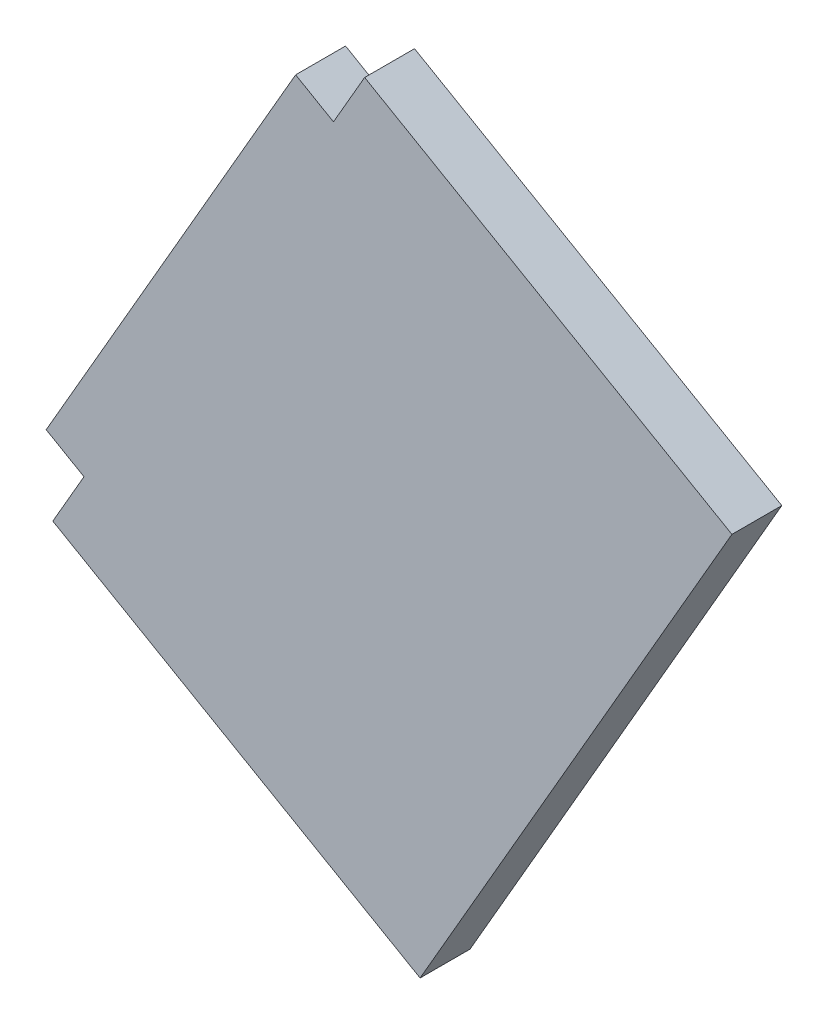
ISO-10303-21;
HEADER;
FILE_DESCRIPTION(('STEP AP214'),'2;1');
FILE_NAME('part.step','',(''),(''),'','','');
FILE_SCHEMA(('AUTOMOTIVE_DESIGN { 1 0 10303 214 1 1 1 1 }'));
ENDSEC;
DATA;
#1=APPLICATION_CONTEXT('core data for automotive mechanical design processes');
#2=APPLICATION_PROTOCOL_DEFINITION('international standard','automotive_design',2000,#1);
#3=PRODUCT_CONTEXT('',#1,'mechanical');
#4=PRODUCT('Part','Part','',(#3));
#5=PRODUCT_RELATED_PRODUCT_CATEGORY('part','',(#4));
#6=PRODUCT_DEFINITION_FORMATION('','',#4);
#7=PRODUCT_DEFINITION_CONTEXT('part definition',#1,'design');
#8=PRODUCT_DEFINITION('design','',#6,#7);
#9=PRODUCT_DEFINITION_SHAPE('','',#8);
#10=(LENGTH_UNIT() NAMED_UNIT(*) SI_UNIT(.MILLI.,.METRE.));
#11=(NAMED_UNIT(*) PLANE_ANGLE_UNIT() SI_UNIT($,.RADIAN.));
#12=(NAMED_UNIT(*) SI_UNIT($,.STERADIAN.) SOLID_ANGLE_UNIT());
#13=UNCERTAINTY_MEASURE_WITH_UNIT(LENGTH_MEASURE(1.E-05),#10,'distance_accuracy_value','');
#14=(GEOMETRIC_REPRESENTATION_CONTEXT(3) GLOBAL_UNCERTAINTY_ASSIGNED_CONTEXT((#13)) GLOBAL_UNIT_ASSIGNED_CONTEXT((#10,
#11,#12)) REPRESENTATION_CONTEXT('',''));
#15=CARTESIAN_POINT('',(0.,0.,0.));
#16=DIRECTION('',(0.,0.,1.));
#17=DIRECTION('',(1.,0.,0.));
#18=AXIS2_PLACEMENT_3D('',#15,#16,#17);
#19=CARTESIAN_POINT('',(1.92664718204935,-0.535,0.));
#20=DIRECTION('',(0.499999999999999,0.866025403784439,0.));
#21=DIRECTION('',(-0.866025403784439,0.499999999999999,0.));
#22=AXIS2_PLACEMENT_3D('',#19,#20,#21);
#23=PLANE('',#22);
#24=DIRECTION('',(-0.866025403784439,0.499999999999999,0.));
#25=VECTOR('',#24,1.);
#26=CARTESIAN_POINT('',(1.92664718204935,-0.535,0.08));
#27=LINE('',#26,#25);
#28=CARTESIAN_POINT('',(2.51554445662277,-0.875,0.08));
#29=VERTEX_POINT('',#28);
#30=CARTESIAN_POINT('',(1.92664718204935,-0.535,0.08));
#31=VERTEX_POINT('',#30);
#32=EDGE_CURVE('E130',#29,#31,#27,.T.);
#33=ORIENTED_EDGE('',*,*,#32,.F.);
#34=DIRECTION('',(0.,0.,1.));
#35=VECTOR('',#34,1.);
#36=CARTESIAN_POINT('',(2.51554445662277,-0.875,0.));
#37=LINE('',#36,#35);
#38=CARTESIAN_POINT('',(2.51554445662277,-0.875,0.));
#39=VERTEX_POINT('',#38);
#40=EDGE_CURVE('E11',#39,#29,#37,.T.);
#41=ORIENTED_EDGE('',*,*,#40,.F.);
#42=DIRECTION('',(-0.866025403784439,0.499999999999999,0.));
#43=VECTOR('',#42,1.);
#44=CARTESIAN_POINT('',(1.92664718204935,-0.535,0.));
#45=LINE('',#44,#43);
#46=CARTESIAN_POINT('',(1.92664718204935,-0.535,0.));
#47=VERTEX_POINT('',#46);
#48=EDGE_CURVE('E150',#39,#47,#45,.T.);
#49=ORIENTED_EDGE('',*,*,#48,.T.);
#50=DIRECTION('',(0.,0.,1.));
#51=VECTOR('',#50,1.);
#52=CARTESIAN_POINT('',(1.92664718204935,-0.535,0.));
#53=LINE('',#52,#51);
#54=EDGE_CURVE('E36',#47,#31,#53,.T.);
#55=ORIENTED_EDGE('',*,*,#54,.T.);
#56=EDGE_LOOP('',(#33,#41,#49,#55));
#57=FACE_BOUND('',#56,.T.);
#58=ADVANCED_FACE('F33',(#57),#23,.T.);
#59=CARTESIAN_POINT('',(2.01554445662277,-1.74102540378444,0.));
#60=DIRECTION('',(0.866025403784439,-0.5,0.));
#61=DIRECTION('',(0.5,0.866025403784439,0.));
#62=AXIS2_PLACEMENT_3D('',#59,#60,#61);
#63=PLANE('',#62);
#64=DIRECTION('',(0.5,0.866025403784439,0.));
#65=VECTOR('',#64,1.);
#66=CARTESIAN_POINT('',(2.01554445662277,-1.74102540378444,0.08));
#67=LINE('',#66,#65);
#68=CARTESIAN_POINT('',(2.01554445662277,-1.74102540378444,0.08));
#69=VERTEX_POINT('',#68);
#70=EDGE_CURVE('E148',#69,#29,#67,.T.);
#71=ORIENTED_EDGE('',*,*,#70,.F.);
#72=DIRECTION('',(0.,0.,1.));
#73=VECTOR('',#72,1.);
#74=CARTESIAN_POINT('',(2.01554445662277,-1.74102540378444,0.));
#75=LINE('',#74,#73);
#76=CARTESIAN_POINT('',(2.01554445662277,-1.74102540378444,0.));
#77=VERTEX_POINT('',#76);
#78=EDGE_CURVE('E42',#77,#69,#75,.T.);
#79=ORIENTED_EDGE('',*,*,#78,.F.);
#80=DIRECTION('',(0.5,0.866025403784439,0.));
#81=VECTOR('',#80,1.);
#82=CARTESIAN_POINT('',(2.01554445662277,-1.74102540378444,0.));
#83=LINE('',#82,#81);
#84=EDGE_CURVE('E120',#77,#39,#83,.T.);
#85=ORIENTED_EDGE('',*,*,#84,.T.);
#86=ORIENTED_EDGE('',*,*,#40,.T.);
#87=EDGE_LOOP('',(#71,#79,#85,#86));
#88=FACE_BOUND('',#87,.T.);
#89=ADVANCED_FACE('F162',(#88),#63,.T.);
#90=CARTESIAN_POINT('',(1.42664718204935,-1.40102540378444,0.));
#91=DIRECTION('',(-0.5,-0.866025403784439,0.));
#92=DIRECTION('',(0.866025403784439,-0.5,0.));
#93=AXIS2_PLACEMENT_3D('',#90,#91,#92);
#94=PLANE('',#93);
#95=DIRECTION('',(0.866025403784439,-0.5,0.));
#96=VECTOR('',#95,1.);
#97=CARTESIAN_POINT('',(1.42664718204935,-1.40102540378444,0.08));
#98=LINE('',#97,#96);
#99=CARTESIAN_POINT('',(1.42664718204935,-1.40102540378444,0.08));
#100=VERTEX_POINT('',#99);
#101=EDGE_CURVE('E107',#100,#69,#98,.T.);
#102=ORIENTED_EDGE('',*,*,#101,.F.);
#103=DIRECTION('',(0.,0.,1.));
#104=VECTOR('',#103,1.);
#105=CARTESIAN_POINT('',(1.42664718204935,-1.40102540378444,0.));
#106=LINE('',#105,#104);
#107=CARTESIAN_POINT('',(1.42664718204935,-1.40102540378444,0.));
#108=VERTEX_POINT('',#107);
#109=EDGE_CURVE('E102',#108,#100,#106,.T.);
#110=ORIENTED_EDGE('',*,*,#109,.F.);
#111=DIRECTION('',(0.866025403784439,-0.5,0.));
#112=VECTOR('',#111,1.);
#113=CARTESIAN_POINT('',(1.42664718204935,-1.40102540378444,0.));
#114=LINE('',#113,#112);
#115=EDGE_CURVE('E105',#108,#77,#114,.T.);
#116=ORIENTED_EDGE('',*,*,#115,.T.);
#117=ORIENTED_EDGE('',*,*,#78,.T.);
#118=EDGE_LOOP('',(#102,#110,#116,#117));
#119=FACE_BOUND('',#118,.T.);
#120=ADVANCED_FACE('F104',(#119),#94,.T.);
#121=CARTESIAN_POINT('',(1.42664718204935,-1.40102540378444,0.));
#122=DIRECTION('',(-0.866025403784439,0.499999999999999,0.));
#123=DIRECTION('',(-0.499999999999999,-0.866025403784439,0.));
#124=AXIS2_PLACEMENT_3D('',#121,#122,#123);
#125=PLANE('',#124);
#126=DIRECTION('',(-0.499999999999999,-0.866025403784439,0.));
#127=VECTOR('',#126,1.);
#128=CARTESIAN_POINT('',(1.42664718204935,-1.40102540378444,0.08));
#129=LINE('',#128,#127);
#130=CARTESIAN_POINT('',(1.47664718204935,-1.31442286340599,0.08));
#131=VERTEX_POINT('',#130);
#132=EDGE_CURVE('E145',#131,#100,#129,.T.);
#133=ORIENTED_EDGE('',*,*,#132,.F.);
#134=DIRECTION('',(0.,0.,1.));
#135=VECTOR('',#134,1.);
#136=CARTESIAN_POINT('',(1.47664718204935,-1.31442286340599,0.));
#137=LINE('',#136,#135);
#138=CARTESIAN_POINT('',(1.47664718204935,-1.31442286340599,0.));
#139=VERTEX_POINT('',#138);
#140=EDGE_CURVE('E112',#139,#131,#137,.T.);
#141=ORIENTED_EDGE('',*,*,#140,.F.);
#142=DIRECTION('',(-0.499999999999999,-0.866025403784439,0.));
#143=VECTOR('',#142,1.);
#144=CARTESIAN_POINT('',(1.42664718204935,-1.40102540378444,0.));
#145=LINE('',#144,#143);
#146=EDGE_CURVE('E118',#139,#108,#145,.T.);
#147=ORIENTED_EDGE('',*,*,#146,.T.);
#148=ORIENTED_EDGE('',*,*,#109,.T.);
#149=EDGE_LOOP('',(#133,#141,#147,#148));
#150=FACE_BOUND('',#149,.T.);
#151=ADVANCED_FACE('F122',(#150),#125,.T.);
#152=CARTESIAN_POINT('',(1.47664718204935,-1.31442286340599,0.));
#153=DIRECTION('',(-0.499999999999997,-0.86602540378444,0.));
#154=DIRECTION('',(0.86602540378444,-0.499999999999997,0.));
#155=AXIS2_PLACEMENT_3D('',#152,#153,#154);
#156=PLANE('',#155);
#157=DIRECTION('',(0.86602540378444,-0.499999999999997,0.));
#158=VECTOR('',#157,1.);
#159=CARTESIAN_POINT('',(1.47664718204935,-1.31442286340599,0.08));
#160=LINE('',#159,#158);
#161=CARTESIAN_POINT('',(1.41602540378444,-1.27942286340599,0.08));
#162=VERTEX_POINT('',#161);
#163=EDGE_CURVE('E142',#162,#131,#160,.T.);
#164=ORIENTED_EDGE('',*,*,#163,.F.);
#165=DIRECTION('',(0.,0.,1.));
#166=VECTOR('',#165,1.);
#167=CARTESIAN_POINT('',(1.41602540378444,-1.27942286340599,0.));
#168=LINE('',#167,#166);
#169=CARTESIAN_POINT('',(1.41602540378444,-1.27942286340599,0.));
#170=VERTEX_POINT('',#169);
#171=EDGE_CURVE('E154',#170,#162,#168,.T.);
#172=ORIENTED_EDGE('',*,*,#171,.F.);
#173=DIRECTION('',(0.86602540378444,-0.499999999999997,0.));
#174=VECTOR('',#173,1.);
#175=CARTESIAN_POINT('',(1.47664718204935,-1.31442286340599,0.));
#176=LINE('',#175,#174);
#177=EDGE_CURVE('E123',#170,#139,#176,.T.);
#178=ORIENTED_EDGE('',*,*,#177,.T.);
#179=ORIENTED_EDGE('',*,*,#140,.T.);
#180=EDGE_LOOP('',(#164,#172,#178,#179));
#181=FACE_BOUND('',#180,.T.);
#182=ADVANCED_FACE('F175',(#181),#156,.T.);
#183=CARTESIAN_POINT('',(1.41602540378444,-1.27942286340599,0.));
#184=DIRECTION('',(-0.866025403784439,0.5,0.));
#185=DIRECTION('',(-0.5,-0.866025403784439,0.));
#186=AXIS2_PLACEMENT_3D('',#183,#184,#185);
#187=PLANE('',#186);
#188=DIRECTION('',(-0.5,-0.866025403784439,0.));
#189=VECTOR('',#188,1.);
#190=CARTESIAN_POINT('',(1.41602540378444,-1.27942286340599,0.08));
#191=LINE('',#190,#189);
#192=CARTESIAN_POINT('',(1.81602540378444,-0.586602540378443,0.08));
#193=VERTEX_POINT('',#192);
#194=EDGE_CURVE('E139',#193,#162,#191,.T.);
#195=ORIENTED_EDGE('',*,*,#194,.F.);
#196=DIRECTION('',(0.,0.,1.));
#197=VECTOR('',#196,1.);
#198=CARTESIAN_POINT('',(1.81602540378444,-0.586602540378443,0.));
#199=LINE('',#198,#197);
#200=CARTESIAN_POINT('',(1.81602540378444,-0.586602540378443,0.));
#201=VERTEX_POINT('',#200);
#202=EDGE_CURVE('E156',#201,#193,#199,.T.);
#203=ORIENTED_EDGE('',*,*,#202,.F.);
#204=DIRECTION('',(-0.5,-0.866025403784439,0.));
#205=VECTOR('',#204,1.);
#206=CARTESIAN_POINT('',(1.41602540378444,-1.27942286340599,0.));
#207=LINE('',#206,#205);
#208=EDGE_CURVE('E125',#201,#170,#207,.T.);
#209=ORIENTED_EDGE('',*,*,#208,.T.);
#210=ORIENTED_EDGE('',*,*,#171,.T.);
#211=EDGE_LOOP('',(#195,#203,#209,#210));
#212=FACE_BOUND('',#211,.T.);
#213=ADVANCED_FACE('F178',(#212),#187,.T.);
#214=CARTESIAN_POINT('',(1.87664718204935,-0.621602540378444,0.));
#215=DIRECTION('',(0.500000000000002,0.866025403784437,0.));
#216=DIRECTION('',(-0.866025403784437,0.500000000000002,0.));
#217=AXIS2_PLACEMENT_3D('',#214,#215,#216);
#218=PLANE('',#217);
#219=DIRECTION('',(-0.866025403784437,0.500000000000002,0.));
#220=VECTOR('',#219,1.);
#221=CARTESIAN_POINT('',(1.87664718204935,-0.621602540378444,0.08));
#222=LINE('',#221,#220);
#223=CARTESIAN_POINT('',(1.87664718204935,-0.621602540378444,0.08));
#224=VERTEX_POINT('',#223);
#225=EDGE_CURVE('E136',#224,#193,#222,.T.);
#226=ORIENTED_EDGE('',*,*,#225,.F.);
#227=DIRECTION('',(0.,0.,1.));
#228=VECTOR('',#227,1.);
#229=CARTESIAN_POINT('',(1.87664718204935,-0.621602540378444,0.));
#230=LINE('',#229,#228);
#231=CARTESIAN_POINT('',(1.87664718204935,-0.621602540378444,0.));
#232=VERTEX_POINT('',#231);
#233=EDGE_CURVE('E157',#232,#224,#230,.T.);
#234=ORIENTED_EDGE('',*,*,#233,.F.);
#235=DIRECTION('',(-0.866025403784437,0.500000000000002,0.));
#236=VECTOR('',#235,1.);
#237=CARTESIAN_POINT('',(1.87664718204935,-0.621602540378444,0.));
#238=LINE('',#237,#236);
#239=EDGE_CURVE('E253',#232,#201,#238,.T.);
#240=ORIENTED_EDGE('',*,*,#239,.T.);
#241=ORIENTED_EDGE('',*,*,#202,.T.);
#242=EDGE_LOOP('',(#226,#234,#240,#241));
#243=FACE_BOUND('',#242,.T.);
#244=ADVANCED_FACE('F182',(#243),#218,.T.);
#245=CARTESIAN_POINT('',(1.92664718204935,-0.535,0.));
#246=DIRECTION('',(-0.86602540378444,0.499999999999998,0.));
#247=DIRECTION('',(-0.499999999999998,-0.86602540378444,0.));
#248=AXIS2_PLACEMENT_3D('',#245,#246,#247);
#249=PLANE('',#248);
#250=DIRECTION('',(-0.499999999999998,-0.86602540378444,0.));
#251=VECTOR('',#250,1.);
#252=CARTESIAN_POINT('',(1.92664718204935,-0.535,0.08));
#253=LINE('',#252,#251);
#254=EDGE_CURVE('E133',#31,#224,#253,.T.);
#255=ORIENTED_EDGE('',*,*,#254,.F.);
#256=ORIENTED_EDGE('',*,*,#54,.F.);
#257=DIRECTION('',(-0.499999999999998,-0.86602540378444,0.));
#258=VECTOR('',#257,1.);
#259=CARTESIAN_POINT('',(1.92664718204935,-0.535,0.));
#260=LINE('',#259,#258);
#261=EDGE_CURVE('E254',#47,#232,#260,.T.);
#262=ORIENTED_EDGE('',*,*,#261,.T.);
#263=ORIENTED_EDGE('',*,*,#233,.T.);
#264=EDGE_LOOP('',(#255,#256,#262,#263));
#265=FACE_BOUND('',#264,.T.);
#266=ADVANCED_FACE('F159',(#265),#249,.T.);
#267=CARTESIAN_POINT('',(0.,0.,0.));
#268=DIRECTION('',(0.,0.,1.));
#269=DIRECTION('',(1.,0.,0.));
#270=AXIS2_PLACEMENT_3D('',#267,#268,#269);
#271=PLANE('',#270);
#272=ORIENTED_EDGE('',*,*,#48,.F.);
#273=ORIENTED_EDGE('',*,*,#84,.F.);
#274=ORIENTED_EDGE('',*,*,#115,.F.);
#275=ORIENTED_EDGE('',*,*,#146,.F.);
#276=ORIENTED_EDGE('',*,*,#177,.F.);
#277=ORIENTED_EDGE('',*,*,#208,.F.);
#278=ORIENTED_EDGE('',*,*,#239,.F.);
#279=ORIENTED_EDGE('',*,*,#261,.F.);
#280=EDGE_LOOP('',(#272,#273,#274,#275,#276,#277,#278,#279));
#281=FACE_BOUND('',#280,.T.);
#282=ADVANCED_FACE('F116',(#281),#271,.F.);
#283=CARTESIAN_POINT('',(0.,0.,0.08));
#284=DIRECTION('',(0.,0.,1.));
#285=DIRECTION('',(1.,0.,0.));
#286=AXIS2_PLACEMENT_3D('',#283,#284,#285);
#287=PLANE('',#286);
#288=ORIENTED_EDGE('',*,*,#32,.T.);
#289=ORIENTED_EDGE('',*,*,#254,.T.);
#290=ORIENTED_EDGE('',*,*,#225,.T.);
#291=ORIENTED_EDGE('',*,*,#194,.T.);
#292=ORIENTED_EDGE('',*,*,#163,.T.);
#293=ORIENTED_EDGE('',*,*,#132,.T.);
#294=ORIENTED_EDGE('',*,*,#101,.T.);
#295=ORIENTED_EDGE('',*,*,#70,.T.);
#296=EDGE_LOOP('',(#288,#289,#290,#291,#292,#293,#294,#295));
#297=FACE_BOUND('',#296,.T.);
#298=ADVANCED_FACE('F161',(#297),#287,.T.);
#299=CLOSED_SHELL('',(#58,#89,#120,#151,#182,#213,#244,#266,#282,#298));
#300=MANIFOLD_SOLID_BREP('B2',#299);
#301=ADVANCED_BREP_SHAPE_REPRESENTATION('',(#18,#300),#14);
#302=SHAPE_DEFINITION_REPRESENTATION(#9,#301);
ENDSEC;
END-ISO-10303-21;
